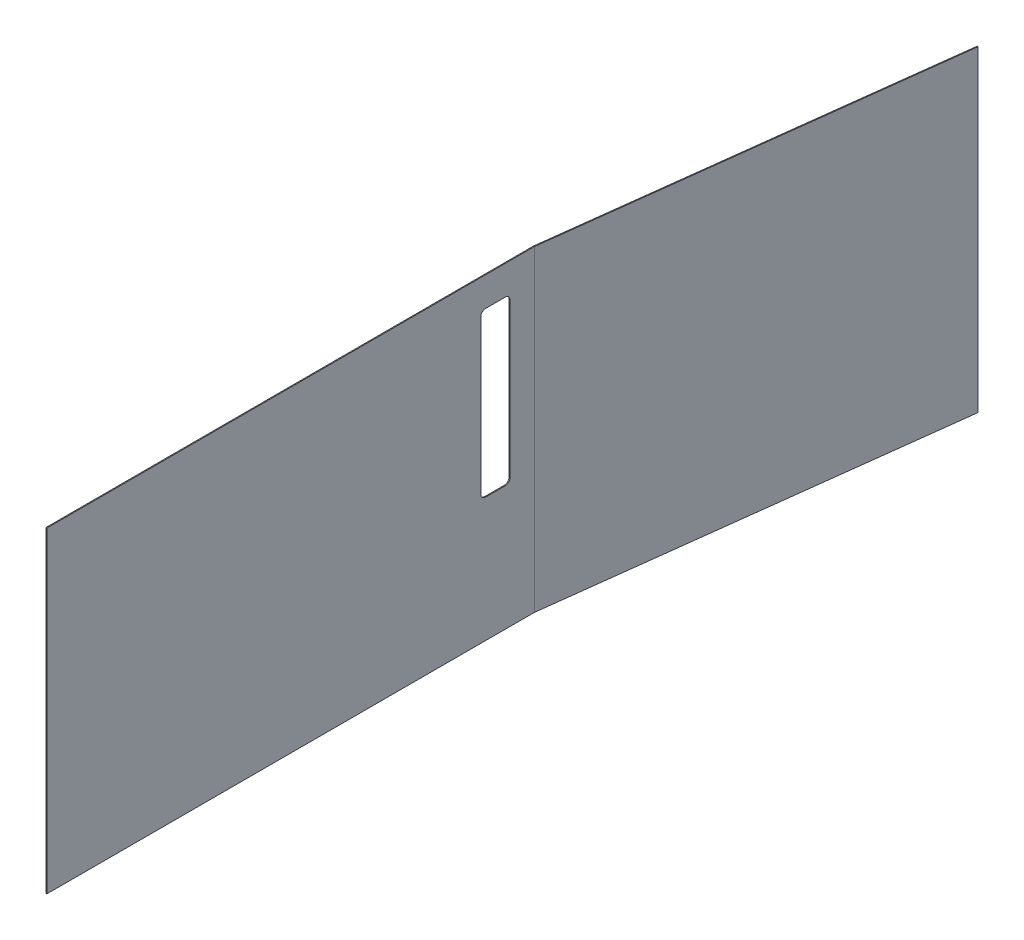
ISO-10303-21;
HEADER;
FILE_DESCRIPTION(('STEP AP214'),'2;1');
FILE_NAME('part.step','',(''),(''),'','','');
FILE_SCHEMA(('AUTOMOTIVE_DESIGN { 1 0 10303 214 1 1 1 1 }'));
ENDSEC;
DATA;
#1=APPLICATION_CONTEXT('core data for automotive mechanical design processes');
#2=APPLICATION_PROTOCOL_DEFINITION('international standard','automotive_design',2000,#1);
#3=PRODUCT_CONTEXT('',#1,'mechanical');
#4=PRODUCT('Part','Part','',(#3));
#5=PRODUCT_RELATED_PRODUCT_CATEGORY('part','',(#4));
#6=PRODUCT_DEFINITION_FORMATION('','',#4);
#7=PRODUCT_DEFINITION_CONTEXT('part definition',#1,'design');
#8=PRODUCT_DEFINITION('design','',#6,#7);
#9=PRODUCT_DEFINITION_SHAPE('','',#8);
#10=(LENGTH_UNIT() NAMED_UNIT(*) SI_UNIT(.MILLI.,.METRE.));
#11=(NAMED_UNIT(*) PLANE_ANGLE_UNIT() SI_UNIT($,.RADIAN.));
#12=(NAMED_UNIT(*) SI_UNIT($,.STERADIAN.) SOLID_ANGLE_UNIT());
#13=UNCERTAINTY_MEASURE_WITH_UNIT(LENGTH_MEASURE(1.E-05),#10,'distance_accuracy_value','');
#14=(GEOMETRIC_REPRESENTATION_CONTEXT(3) GLOBAL_UNCERTAINTY_ASSIGNED_CONTEXT((#13)) GLOBAL_UNIT_ASSIGNED_CONTEXT((#10,
#11,#12)) REPRESENTATION_CONTEXT('',''));
#15=CARTESIAN_POINT('',(0.,0.,0.));
#16=DIRECTION('',(0.,0.,1.));
#17=DIRECTION('',(1.,0.,0.));
#18=AXIS2_PLACEMENT_3D('',#15,#16,#17);
#19=CARTESIAN_POINT('',(0.,650.,0.0452971883437847));
#20=DIRECTION('',(0.,1.,0.));
#21=DIRECTION('',(0.,0.,1.));
#22=AXIS2_PLACEMENT_3D('',#19,#20,#21);
#23=PLANE('',#22);
#24=DIRECTION('',(-1.,0.,0.));
#25=VECTOR('',#24,1.);
#26=CARTESIAN_POINT('',(0.,650.,0.0452971883437847));
#27=LINE('',#26,#25);
#28=CARTESIAN_POINT('',(0.,650.,0.0452971883437847));
#29=VERTEX_POINT('',#28);
#30=CARTESIAN_POINT('',(-1.90000000000001,650.,0.0452971883438525));
#31=VERTEX_POINT('',#30);
#32=EDGE_CURVE('E277',#29,#31,#27,.T.);
#33=ORIENTED_EDGE('',*,*,#32,.F.);
#34=CARTESIAN_POINT('',(0.736599999999987,650.,0.045297188343758));
#35=DIRECTION('',(0.,1.,0.));
#36=DIRECTION('',(0.,0.,1.));
#37=AXIS2_PLACEMENT_3D('',#34,#35,#36);
#38=CIRCLE('',#37,0.7366);
#39=CARTESIAN_POINT('',(0.0055501092090609,650.,-0.0449558845933933));
#40=VERTEX_POINT('',#39);
#41=EDGE_CURVE('E226',#29,#40,#38,.F.);
#42=ORIENTED_EDGE('',*,*,#41,.T.);
#43=DIRECTION('',(0.992465233221436,0.,0.122526572002646));
#44=VECTOR('',#43,1.);
#45=CARTESIAN_POINT('',(-1.88013383391167,650.,-0.277756371398422));
#46=LINE('',#45,#44);
#47=CARTESIAN_POINT('',(-1.88013383391167,650.,-0.277756371398422));
#48=VERTEX_POINT('',#47);
#49=EDGE_CURVE('E275',#48,#40,#46,.T.);
#50=ORIENTED_EDGE('',*,*,#49,.F.);
#51=CARTESIAN_POINT('',(0.736599999999987,650.,0.045297188343758));
#52=DIRECTION('',(0.,1.,0.));
#53=DIRECTION('',(1.,0.,0.));
#54=AXIS2_PLACEMENT_3D('',#51,#52,#53);
#55=CIRCLE('',#54,2.6366);
#56=EDGE_CURVE('E214',#31,#48,#55,.F.);
#57=ORIENTED_EDGE('',*,*,#56,.F.);
#58=EDGE_LOOP('',(#33,#42,#50,#57));
#59=FACE_BOUND('',#58,.T.);
#60=ADVANCED_FACE('F43',(#59),#23,.T.);
#61=CARTESIAN_POINT('',(-1.88013383391167,650.,-0.277756371398422));
#62=DIRECTION('',(0.,1.,0.));
#63=DIRECTION('',(0.,0.,1.));
#64=AXIS2_PLACEMENT_3D('',#61,#62,#63);
#65=PLANE('',#64);
#66=DIRECTION('',(0.,0.,-1.));
#67=VECTOR('',#66,1.);
#68=CARTESIAN_POINT('',(0.,650.,1000.));
#69=LINE('',#68,#67);
#70=CARTESIAN_POINT('',(0.,650.,1000.));
#71=VERTEX_POINT('',#70);
#72=EDGE_CURVE('E223',#71,#29,#69,.T.);
#73=ORIENTED_EDGE('',*,*,#72,.T.);
#74=ORIENTED_EDGE('',*,*,#32,.T.);
#75=DIRECTION('',(0.,0.,-1.));
#76=VECTOR('',#75,1.);
#77=CARTESIAN_POINT('',(-1.9,650.,1000.));
#78=LINE('',#77,#76);
#79=CARTESIAN_POINT('',(-1.9,650.,1000.));
#80=VERTEX_POINT('',#79);
#81=EDGE_CURVE('E217',#80,#31,#78,.T.);
#82=ORIENTED_EDGE('',*,*,#81,.F.);
#83=DIRECTION('',(-1.,0.,0.));
#84=VECTOR('',#83,1.);
#85=CARTESIAN_POINT('',(0.,650.,1000.));
#86=LINE('',#85,#84);
#87=EDGE_CURVE('E220',#71,#80,#86,.T.);
#88=ORIENTED_EDGE('',*,*,#87,.F.);
#89=EDGE_LOOP('',(#73,#74,#82,#88));
#90=FACE_BOUND('',#89,.T.);
#91=ADVANCED_FACE('F330',(#90),#65,.T.);
#92=CARTESIAN_POINT('',(0.0055501092090609,0.,-0.0449558845933933));
#93=DIRECTION('',(0.,-1.,0.));
#94=DIRECTION('',(0.,0.,-1.));
#95=AXIS2_PLACEMENT_3D('',#92,#93,#94);
#96=PLANE('',#95);
#97=DIRECTION('',(-0.992465233221436,0.,-0.122526572002646));
#98=VECTOR('',#97,1.);
#99=CARTESIAN_POINT('',(0.0055501092090609,0.,-0.0449558845933933));
#100=LINE('',#99,#98);
#101=CARTESIAN_POINT('',(0.0055501092090609,0.,-0.0449558845933933));
#102=VERTEX_POINT('',#101);
#103=CARTESIAN_POINT('',(-1.88013383391167,0.,-0.277756371398422));
#104=VERTEX_POINT('',#103);
#105=EDGE_CURVE('E273',#102,#104,#100,.T.);
#106=ORIENTED_EDGE('',*,*,#105,.F.);
#107=CARTESIAN_POINT('',(0.736599999999987,0.,0.045297188343758));
#108=DIRECTION('',(0.,1.,0.));
#109=DIRECTION('',(0.,0.,1.));
#110=AXIS2_PLACEMENT_3D('',#107,#108,#109);
#111=CIRCLE('',#110,0.7366);
#112=CARTESIAN_POINT('',(0.,0.,0.0452971883437847));
#113=VERTEX_POINT('',#112);
#114=EDGE_CURVE('E208',#113,#102,#111,.F.);
#115=ORIENTED_EDGE('',*,*,#114,.F.);
#116=DIRECTION('',(1.,0.,0.));
#117=VECTOR('',#116,1.);
#118=CARTESIAN_POINT('',(-1.90000000000001,0.,0.0452971883438525));
#119=LINE('',#118,#117);
#120=CARTESIAN_POINT('',(-1.90000000000001,0.,0.0452971883438525));
#121=VERTEX_POINT('',#120);
#122=EDGE_CURVE('E271',#121,#113,#119,.T.);
#123=ORIENTED_EDGE('',*,*,#122,.F.);
#124=CARTESIAN_POINT('',(0.736599999999987,0.,0.045297188343758));
#125=DIRECTION('',(0.,1.,0.));
#126=DIRECTION('',(1.,0.,0.));
#127=AXIS2_PLACEMENT_3D('',#124,#125,#126);
#128=CIRCLE('',#127,2.6366);
#129=EDGE_CURVE('E238',#121,#104,#128,.F.);
#130=ORIENTED_EDGE('',*,*,#129,.T.);
#131=EDGE_LOOP('',(#106,#115,#123,#130));
#132=FACE_BOUND('',#131,.T.);
#133=ADVANCED_FACE('F335',(#132),#96,.T.);
#134=CARTESIAN_POINT('',(-1.90000000000001,0.,0.0452971883438525));
#135=DIRECTION('',(0.,-1.,0.));
#136=DIRECTION('',(0.,0.,-1.));
#137=AXIS2_PLACEMENT_3D('',#134,#135,#136);
#138=PLANE('',#137);
#139=DIRECTION('',(0.122526572002646,0.,-0.992465233221436));
#140=VECTOR('',#139,1.);
#141=CARTESIAN_POINT('',(0.,0.,0.));
#142=LINE('',#141,#140);
#143=CARTESIAN_POINT('',(100.,0.,-810.));
#144=VERTEX_POINT('',#143);
#145=EDGE_CURVE('E194',#102,#144,#142,.T.);
#146=ORIENTED_EDGE('',*,*,#145,.F.);
#147=ORIENTED_EDGE('',*,*,#105,.T.);
#148=DIRECTION('',(0.122526572002646,0.,-0.992465233221437));
#149=VECTOR('',#148,1.);
#150=CARTESIAN_POINT('',(-1.88568394312073,0.,-0.232800486805028));
#151=LINE('',#150,#149);
#152=CARTESIAN_POINT('',(98.1143160568793,0.,-810.232800486805));
#153=VERTEX_POINT('',#152);
#154=EDGE_CURVE('E235',#104,#153,#151,.T.);
#155=ORIENTED_EDGE('',*,*,#154,.T.);
#156=DIRECTION('',(0.992465233221412,0.,0.122526572002845));
#157=VECTOR('',#156,1.);
#158=CARTESIAN_POINT('',(98.1143160568793,0.,-810.232800486805));
#159=LINE('',#158,#157);
#160=EDGE_CURVE('E232',#153,#144,#159,.T.);
#161=ORIENTED_EDGE('',*,*,#160,.T.);
#162=EDGE_LOOP('',(#146,#147,#155,#161));
#163=FACE_BOUND('',#162,.T.);
#164=ADVANCED_FACE('F370',(#163),#138,.T.);
#165=CARTESIAN_POINT('',(0.,650.,0.));
#166=DIRECTION('',(-0.992465233221437,0.,-0.122526572002646));
#167=DIRECTION('',(-0.122526572002646,0.,0.992465233221437));
#168=AXIS2_PLACEMENT_3D('',#165,#166,#167);
#169=PLANE('',#168);
#170=ORIENTED_EDGE('',*,*,#145,.T.);
#171=DIRECTION('',(0.,-1.,0.));
#172=VECTOR('',#171,1.);
#173=CARTESIAN_POINT('',(100.,650.,-810.));
#174=LINE('',#173,#172);
#175=CARTESIAN_POINT('',(100.,650.,-810.));
#176=VERTEX_POINT('',#175);
#177=EDGE_CURVE('E269',#176,#144,#174,.T.);
#178=ORIENTED_EDGE('',*,*,#177,.F.);
#179=DIRECTION('',(0.122526572002646,0.,-0.992465233221436));
#180=VECTOR('',#179,1.);
#181=CARTESIAN_POINT('',(0.,650.,0.));
#182=LINE('',#181,#180);
#183=EDGE_CURVE('E205',#40,#176,#182,.T.);
#184=ORIENTED_EDGE('',*,*,#183,.F.);
#185=DIRECTION('',(0.,-1.,0.));
#186=VECTOR('',#185,1.);
#187=CARTESIAN_POINT('',(0.0055501092090609,650.,-0.0449558845933933));
#188=LINE('',#187,#186);
#189=EDGE_CURVE('E229',#40,#102,#188,.T.);
#190=ORIENTED_EDGE('',*,*,#189,.T.);
#191=EDGE_LOOP('',(#170,#178,#184,#190));
#192=FACE_BOUND('',#191,.T.);
#193=ADVANCED_FACE('F353',(#192),#169,.F.);
#194=CARTESIAN_POINT('',(98.1143160568793,650.,-810.232800486805));
#195=DIRECTION('',(0.122526572002845,0.,-0.992465233221412));
#196=DIRECTION('',(-0.992465233221412,0.,-0.122526572002845));
#197=AXIS2_PLACEMENT_3D('',#194,#195,#196);
#198=PLANE('',#197);
#199=ORIENTED_EDGE('',*,*,#160,.F.);
#200=DIRECTION('',(0.,-1.,0.));
#201=VECTOR('',#200,1.);
#202=CARTESIAN_POINT('',(98.1143160568793,650.,-810.232800486805));
#203=LINE('',#202,#201);
#204=CARTESIAN_POINT('',(98.1143160568793,650.,-810.232800486805));
#205=VERTEX_POINT('',#204);
#206=EDGE_CURVE('E267',#205,#153,#203,.T.);
#207=ORIENTED_EDGE('',*,*,#206,.F.);
#208=DIRECTION('',(0.992465233221412,0.,0.122526572002845));
#209=VECTOR('',#208,1.);
#210=CARTESIAN_POINT('',(98.1143160568793,650.,-810.232800486805));
#211=LINE('',#210,#209);
#212=EDGE_CURVE('E207',#205,#176,#211,.T.);
#213=ORIENTED_EDGE('',*,*,#212,.T.);
#214=ORIENTED_EDGE('',*,*,#177,.T.);
#215=EDGE_LOOP('',(#199,#207,#213,#214));
#216=FACE_BOUND('',#215,.T.);
#217=ADVANCED_FACE('F373',(#216),#198,.T.);
#218=CARTESIAN_POINT('',(-1.88568394312073,650.,-0.232800486805028));
#219=DIRECTION('',(-0.992465233221436,0.,-0.122526572002646));
#220=DIRECTION('',(-0.122526572002646,0.,0.992465233221436));
#221=AXIS2_PLACEMENT_3D('',#218,#219,#220);
#222=PLANE('',#221);
#223=ORIENTED_EDGE('',*,*,#154,.F.);
#224=DIRECTION('',(0.,-1.,0.));
#225=VECTOR('',#224,1.);
#226=CARTESIAN_POINT('',(-1.88013383391167,650.,-0.277756371398422));
#227=LINE('',#226,#225);
#228=EDGE_CURVE('E264',#48,#104,#227,.T.);
#229=ORIENTED_EDGE('',*,*,#228,.F.);
#230=DIRECTION('',(0.122526572002646,0.,-0.992465233221437));
#231=VECTOR('',#230,1.);
#232=CARTESIAN_POINT('',(-1.88568394312073,650.,-0.232800486805028));
#233=LINE('',#232,#231);
#234=EDGE_CURVE('E211',#48,#205,#233,.T.);
#235=ORIENTED_EDGE('',*,*,#234,.T.);
#236=ORIENTED_EDGE('',*,*,#206,.T.);
#237=EDGE_LOOP('',(#223,#229,#235,#236));
#238=FACE_BOUND('',#237,.T.);
#239=ADVANCED_FACE('F360',(#238),#222,.T.);
#240=CARTESIAN_POINT('',(0.736599999999987,650.,0.045297188343758));
#241=DIRECTION('',(0.,-1.,0.));
#242=DIRECTION('',(0.,0.,-1.));
#243=AXIS2_PLACEMENT_3D('',#240,#241,#242);
#244=CYLINDRICAL_SURFACE('',#243,2.6366);
#245=ORIENTED_EDGE('',*,*,#129,.F.);
#246=DIRECTION('',(0.,-1.,0.));
#247=VECTOR('',#246,1.);
#248=CARTESIAN_POINT('',(-1.90000000000001,650.,0.0452971883438525));
#249=LINE('',#248,#247);
#250=EDGE_CURVE('E261',#31,#121,#249,.T.);
#251=ORIENTED_EDGE('',*,*,#250,.F.);
#252=ORIENTED_EDGE('',*,*,#56,.T.);
#253=ORIENTED_EDGE('',*,*,#228,.T.);
#254=EDGE_LOOP('',(#245,#251,#252,#253));
#255=FACE_BOUND('',#254,.T.);
#256=ADVANCED_FACE('F363',(#255),#244,.T.);
#257=CARTESIAN_POINT('',(-1.9,650.,1000.));
#258=DIRECTION('',(-1.,0.,0.));
#259=DIRECTION('',(0.,0.,1.));
#260=AXIS2_PLACEMENT_3D('',#257,#258,#259);
#261=PLANE('',#260);
#262=CARTESIAN_POINT('',(-1.9,265.,100.));
#263=DIRECTION('',(-1.,0.,0.));
#264=DIRECTION('',(0.,0.,1.));
#265=AXIS2_PLACEMENT_3D('',#262,#263,#264);
#266=CIRCLE('',#265,10.);
#267=CARTESIAN_POINT('',(-1.9,255.,100.));
#268=VERTEX_POINT('',#267);
#269=CARTESIAN_POINT('',(-1.9,265.,110.));
#270=VERTEX_POINT('',#269);
#271=EDGE_CURVE('E57',#268,#270,#266,.T.);
#272=ORIENTED_EDGE('',*,*,#271,.F.);
#273=DIRECTION('',(0.,0.,1.));
#274=VECTOR('',#273,1.);
#275=CARTESIAN_POINT('',(-1.9,255.,60.));
#276=LINE('',#275,#274);
#277=CARTESIAN_POINT('',(-1.9,255.,60.));
#278=VERTEX_POINT('',#277);
#279=EDGE_CURVE('E189',#278,#268,#276,.T.);
#280=ORIENTED_EDGE('',*,*,#279,.F.);
#281=CARTESIAN_POINT('',(-1.9,265.,60.));
#282=DIRECTION('',(-1.,0.,0.));
#283=DIRECTION('',(0.,0.,1.));
#284=AXIS2_PLACEMENT_3D('',#281,#282,#283);
#285=CIRCLE('',#284,10.);
#286=CARTESIAN_POINT('',(-1.9,265.,50.));
#287=VERTEX_POINT('',#286);
#288=EDGE_CURVE('E186',#287,#278,#285,.T.);
#289=ORIENTED_EDGE('',*,*,#288,.F.);
#290=DIRECTION('',(0.,-1.,0.));
#291=VECTOR('',#290,1.);
#292=CARTESIAN_POINT('',(-1.9,580.,50.));
#293=LINE('',#292,#291);
#294=CARTESIAN_POINT('',(-1.9,580.,50.));
#295=VERTEX_POINT('',#294);
#296=EDGE_CURVE('E183',#295,#287,#293,.T.);
#297=ORIENTED_EDGE('',*,*,#296,.F.);
#298=CARTESIAN_POINT('',(-1.9,580.,60.));
#299=DIRECTION('',(-1.,0.,0.));
#300=DIRECTION('',(0.,0.,1.));
#301=AXIS2_PLACEMENT_3D('',#298,#299,#300);
#302=CIRCLE('',#301,10.);
#303=CARTESIAN_POINT('',(-1.9,590.,60.));
#304=VERTEX_POINT('',#303);
#305=EDGE_CURVE('E177',#304,#295,#302,.T.);
#306=ORIENTED_EDGE('',*,*,#305,.F.);
#307=DIRECTION('',(0.,0.,-1.));
#308=VECTOR('',#307,1.);
#309=CARTESIAN_POINT('',(-1.9,590.,60.));
#310=LINE('',#309,#308);
#311=CARTESIAN_POINT('',(-1.9,590.,100.));
#312=VERTEX_POINT('',#311);
#313=EDGE_CURVE('E175',#312,#304,#310,.T.);
#314=ORIENTED_EDGE('',*,*,#313,.F.);
#315=CARTESIAN_POINT('',(-1.9,580.,100.));
#316=DIRECTION('',(-1.,0.,0.));
#317=DIRECTION('',(0.,0.,-1.));
#318=AXIS2_PLACEMENT_3D('',#315,#316,#317);
#319=CIRCLE('',#318,10.);
#320=CARTESIAN_POINT('',(-1.9,580.,110.));
#321=VERTEX_POINT('',#320);
#322=EDGE_CURVE('E158',#321,#312,#319,.T.);
#323=ORIENTED_EDGE('',*,*,#322,.F.);
#324=DIRECTION('',(0.,1.,0.));
#325=VECTOR('',#324,1.);
#326=CARTESIAN_POINT('',(-1.9,580.,110.));
#327=LINE('',#326,#325);
#328=EDGE_CURVE('E167',#270,#321,#327,.T.);
#329=ORIENTED_EDGE('',*,*,#328,.F.);
#330=EDGE_LOOP('',(#272,#280,#289,#297,#306,#314,#323,#329));
#331=FACE_BOUND('',#330,.T.);
#332=DIRECTION('',(0.,0.,-1.));
#333=VECTOR('',#332,1.);
#334=CARTESIAN_POINT('',(-1.9,0.,1000.));
#335=LINE('',#334,#333);
#336=CARTESIAN_POINT('',(-1.9,0.,1000.));
#337=VERTEX_POINT('',#336);
#338=EDGE_CURVE('E241',#337,#121,#335,.T.);
#339=ORIENTED_EDGE('',*,*,#338,.F.);
#340=DIRECTION('',(0.,-1.,0.));
#341=VECTOR('',#340,1.);
#342=CARTESIAN_POINT('',(-1.9,650.,1000.));
#343=LINE('',#342,#341);
#344=EDGE_CURVE('E259',#80,#337,#343,.T.);
#345=ORIENTED_EDGE('',*,*,#344,.F.);
#346=ORIENTED_EDGE('',*,*,#81,.T.);
#347=ORIENTED_EDGE('',*,*,#250,.T.);
#348=EDGE_LOOP('',(#339,#345,#346,#347));
#349=FACE_BOUND('',#348,.T.);
#350=ADVANCED_FACE('F171',(#331,#349),#261,.T.);
#351=CARTESIAN_POINT('',(0.,650.,1000.));
#352=DIRECTION('',(0.,0.,1.));
#353=DIRECTION('',(1.,0.,0.));
#354=AXIS2_PLACEMENT_3D('',#351,#352,#353);
#355=PLANE('',#354);
#356=DIRECTION('',(-1.,0.,0.));
#357=VECTOR('',#356,1.);
#358=CARTESIAN_POINT('',(0.,0.,1000.));
#359=LINE('',#358,#357);
#360=CARTESIAN_POINT('',(0.,0.,1000.));
#361=VERTEX_POINT('',#360);
#362=EDGE_CURVE('E244',#361,#337,#359,.T.);
#363=ORIENTED_EDGE('',*,*,#362,.F.);
#364=DIRECTION('',(0.,-1.,0.));
#365=VECTOR('',#364,1.);
#366=CARTESIAN_POINT('',(0.,650.,1000.));
#367=LINE('',#366,#365);
#368=EDGE_CURVE('E257',#71,#361,#367,.T.);
#369=ORIENTED_EDGE('',*,*,#368,.F.);
#370=ORIENTED_EDGE('',*,*,#87,.T.);
#371=ORIENTED_EDGE('',*,*,#344,.T.);
#372=EDGE_LOOP('',(#363,#369,#370,#371));
#373=FACE_BOUND('',#372,.T.);
#374=ADVANCED_FACE('F367',(#373),#355,.T.);
#375=CARTESIAN_POINT('',(0.,650.,1000.));
#376=DIRECTION('',(-1.,0.,0.));
#377=DIRECTION('',(0.,0.,1.));
#378=AXIS2_PLACEMENT_3D('',#375,#376,#377);
#379=PLANE('',#378);
#380=DIRECTION('',(0.,0.,1.));
#381=VECTOR('',#380,1.);
#382=CARTESIAN_POINT('',(0.,254.999999999999,999.999999999999));
#383=LINE('',#382,#381);
#384=CARTESIAN_POINT('',(0.,255.,60.));
#385=VERTEX_POINT('',#384);
#386=CARTESIAN_POINT('',(0.,255.,100.));
#387=VERTEX_POINT('',#386);
#388=EDGE_CURVE('E50',#385,#387,#383,.T.);
#389=ORIENTED_EDGE('',*,*,#388,.T.);
#390=CARTESIAN_POINT('',(0.,265.,100.));
#391=DIRECTION('',(-1.,0.,0.));
#392=DIRECTION('',(0.,0.,1.));
#393=AXIS2_PLACEMENT_3D('',#390,#391,#392);
#394=CIRCLE('',#393,10.);
#395=CARTESIAN_POINT('',(0.,265.,110.));
#396=VERTEX_POINT('',#395);
#397=EDGE_CURVE('E11',#387,#396,#394,.T.);
#398=ORIENTED_EDGE('',*,*,#397,.T.);
#399=DIRECTION('',(0.,1.,0.));
#400=VECTOR('',#399,1.);
#401=CARTESIAN_POINT('',(0.,650.,110.));
#402=LINE('',#401,#400);
#403=CARTESIAN_POINT('',(0.,580.,110.));
#404=VERTEX_POINT('',#403);
#405=EDGE_CURVE('E279',#396,#404,#402,.T.);
#406=ORIENTED_EDGE('',*,*,#405,.T.);
#407=CARTESIAN_POINT('',(0.,580.,100.));
#408=DIRECTION('',(-1.,0.,0.));
#409=DIRECTION('',(0.,0.,1.));
#410=AXIS2_PLACEMENT_3D('',#407,#408,#409);
#411=CIRCLE('',#410,10.);
#412=CARTESIAN_POINT('',(0.,590.,100.));
#413=VERTEX_POINT('',#412);
#414=EDGE_CURVE('E161',#404,#413,#411,.T.);
#415=ORIENTED_EDGE('',*,*,#414,.T.);
#416=DIRECTION('',(0.,0.,-1.));
#417=VECTOR('',#416,1.);
#418=CARTESIAN_POINT('',(0.,590.,1000.));
#419=LINE('',#418,#417);
#420=CARTESIAN_POINT('',(0.,590.,60.));
#421=VERTEX_POINT('',#420);
#422=EDGE_CURVE('E282',#413,#421,#419,.T.);
#423=ORIENTED_EDGE('',*,*,#422,.T.);
#424=CARTESIAN_POINT('',(0.,580.,60.));
#425=DIRECTION('',(-1.,0.,0.));
#426=DIRECTION('',(0.,0.,1.));
#427=AXIS2_PLACEMENT_3D('',#424,#425,#426);
#428=CIRCLE('',#427,10.);
#429=CARTESIAN_POINT('',(0.,580.,50.));
#430=VERTEX_POINT('',#429);
#431=EDGE_CURVE('E285',#421,#430,#428,.T.);
#432=ORIENTED_EDGE('',*,*,#431,.T.);
#433=DIRECTION('',(0.,-1.,0.));
#434=VECTOR('',#433,1.);
#435=CARTESIAN_POINT('',(0.,650.,49.9999999999999));
#436=LINE('',#435,#434);
#437=CARTESIAN_POINT('',(0.,265.,50.));
#438=VERTEX_POINT('',#437);
#439=EDGE_CURVE('E288',#430,#438,#436,.T.);
#440=ORIENTED_EDGE('',*,*,#439,.T.);
#441=CARTESIAN_POINT('',(0.,265.,60.));
#442=DIRECTION('',(-1.,0.,0.));
#443=DIRECTION('',(0.,0.,1.));
#444=AXIS2_PLACEMENT_3D('',#441,#442,#443);
#445=CIRCLE('',#444,10.);
#446=EDGE_CURVE('E291',#438,#385,#445,.T.);
#447=ORIENTED_EDGE('',*,*,#446,.T.);
#448=EDGE_LOOP('',(#389,#398,#406,#415,#423,#432,#440,#447));
#449=FACE_BOUND('',#448,.T.);
#450=DIRECTION('',(0.,0.,-1.));
#451=VECTOR('',#450,1.);
#452=CARTESIAN_POINT('',(0.,0.,1000.));
#453=LINE('',#452,#451);
#454=EDGE_CURVE('E247',#361,#113,#453,.T.);
#455=ORIENTED_EDGE('',*,*,#454,.T.);
#456=DIRECTION('',(0.,-1.,0.));
#457=VECTOR('',#456,1.);
#458=CARTESIAN_POINT('',(0.,650.,0.0452971883437847));
#459=LINE('',#458,#457);
#460=EDGE_CURVE('E254',#29,#113,#459,.T.);
#461=ORIENTED_EDGE('',*,*,#460,.F.);
#462=ORIENTED_EDGE('',*,*,#72,.F.);
#463=ORIENTED_EDGE('',*,*,#368,.T.);
#464=EDGE_LOOP('',(#455,#461,#462,#463));
#465=FACE_BOUND('',#464,.T.);
#466=ADVANCED_FACE('F295',(#449,#465),#379,.F.);
#467=CARTESIAN_POINT('',(0.736599999999987,650.,0.045297188343758));
#468=DIRECTION('',(0.,-1.,0.));
#469=DIRECTION('',(0.,0.,-1.));
#470=AXIS2_PLACEMENT_3D('',#467,#468,#469);
#471=CYLINDRICAL_SURFACE('',#470,0.7366);
#472=ORIENTED_EDGE('',*,*,#114,.T.);
#473=ORIENTED_EDGE('',*,*,#189,.F.);
#474=ORIENTED_EDGE('',*,*,#41,.F.);
#475=ORIENTED_EDGE('',*,*,#460,.T.);
#476=EDGE_LOOP('',(#472,#473,#474,#475));
#477=FACE_BOUND('',#476,.T.);
#478=ADVANCED_FACE('F348',(#477),#471,.F.);
#479=CARTESIAN_POINT('',(0.736599999999987,650.,0.045297188343758));
#480=DIRECTION('',(0.,1.,0.));
#481=DIRECTION('',(1.,0.,0.));
#482=AXIS2_PLACEMENT_3D('',#479,#480,#481);
#483=PLANE('',#482);
#484=ORIENTED_EDGE('',*,*,#183,.T.);
#485=ORIENTED_EDGE('',*,*,#212,.F.);
#486=ORIENTED_EDGE('',*,*,#234,.F.);
#487=ORIENTED_EDGE('',*,*,#49,.T.);
#488=EDGE_LOOP('',(#484,#485,#486,#487));
#489=FACE_BOUND('',#488,.T.);
#490=ADVANCED_FACE('F324',(#489),#483,.T.);
#491=CARTESIAN_POINT('',(0.736599999999987,0.,0.045297188343758));
#492=DIRECTION('',(0.,1.,0.));
#493=DIRECTION('',(1.,0.,0.));
#494=AXIS2_PLACEMENT_3D('',#491,#492,#493);
#495=PLANE('',#494);
#496=ORIENTED_EDGE('',*,*,#338,.T.);
#497=ORIENTED_EDGE('',*,*,#122,.T.);
#498=ORIENTED_EDGE('',*,*,#454,.F.);
#499=ORIENTED_EDGE('',*,*,#362,.T.);
#500=EDGE_LOOP('',(#496,#497,#498,#499));
#501=FACE_BOUND('',#500,.T.);
#502=ADVANCED_FACE('F317',(#501),#495,.F.);
#503=CARTESIAN_POINT('',(100.,265.,100.));
#504=DIRECTION('',(-1.,0.,0.));
#505=DIRECTION('',(0.,0.,1.));
#506=AXIS2_PLACEMENT_3D('',#503,#504,#505);
#507=CYLINDRICAL_SURFACE('',#506,10.);
#508=DIRECTION('',(-1.,0.,0.));
#509=VECTOR('',#508,1.);
#510=CARTESIAN_POINT('',(100.,255.,100.));
#511=LINE('',#510,#509);
#512=EDGE_CURVE('E192',#387,#268,#511,.T.);
#513=ORIENTED_EDGE('',*,*,#512,.T.);
#514=ORIENTED_EDGE('',*,*,#271,.T.);
#515=DIRECTION('',(-1.,0.,0.));
#516=VECTOR('',#515,1.);
#517=CARTESIAN_POINT('',(100.,265.,110.));
#518=LINE('',#517,#516);
#519=EDGE_CURVE('E164',#396,#270,#518,.T.);
#520=ORIENTED_EDGE('',*,*,#519,.F.);
#521=ORIENTED_EDGE('',*,*,#397,.F.);
#522=EDGE_LOOP('',(#513,#514,#520,#521));
#523=FACE_BOUND('',#522,.T.);
#524=ADVANCED_FACE('F315',(#523),#507,.F.);
#525=CARTESIAN_POINT('',(100.,255.,60.));
#526=DIRECTION('',(0.,-1.,0.));
#527=DIRECTION('',(0.,0.,-1.));
#528=AXIS2_PLACEMENT_3D('',#525,#526,#527);
#529=PLANE('',#528);
#530=DIRECTION('',(-1.,0.,0.));
#531=VECTOR('',#530,1.);
#532=CARTESIAN_POINT('',(100.,255.,60.));
#533=LINE('',#532,#531);
#534=EDGE_CURVE('E195',#385,#278,#533,.T.);
#535=ORIENTED_EDGE('',*,*,#534,.T.);
#536=ORIENTED_EDGE('',*,*,#279,.T.);
#537=ORIENTED_EDGE('',*,*,#512,.F.);
#538=ORIENTED_EDGE('',*,*,#388,.F.);
#539=EDGE_LOOP('',(#535,#536,#537,#538));
#540=FACE_BOUND('',#539,.T.);
#541=ADVANCED_FACE('F300',(#540),#529,.F.);
#542=CARTESIAN_POINT('',(100.,265.,60.));
#543=DIRECTION('',(-1.,0.,0.));
#544=DIRECTION('',(0.,0.,1.));
#545=AXIS2_PLACEMENT_3D('',#542,#543,#544);
#546=CYLINDRICAL_SURFACE('',#545,10.);
#547=DIRECTION('',(-1.,0.,0.));
#548=VECTOR('',#547,1.);
#549=CARTESIAN_POINT('',(100.,265.,50.));
#550=LINE('',#549,#548);
#551=EDGE_CURVE('E197',#438,#287,#550,.T.);
#552=ORIENTED_EDGE('',*,*,#551,.T.);
#553=ORIENTED_EDGE('',*,*,#288,.T.);
#554=ORIENTED_EDGE('',*,*,#534,.F.);
#555=ORIENTED_EDGE('',*,*,#446,.F.);
#556=EDGE_LOOP('',(#552,#553,#554,#555));
#557=FACE_BOUND('',#556,.T.);
#558=ADVANCED_FACE('F302',(#557),#546,.F.);
#559=CARTESIAN_POINT('',(100.,580.,50.));
#560=DIRECTION('',(0.,0.,-1.));
#561=DIRECTION('',(0.,1.,0.));
#562=AXIS2_PLACEMENT_3D('',#559,#560,#561);
#563=PLANE('',#562);
#564=DIRECTION('',(-1.,0.,0.));
#565=VECTOR('',#564,1.);
#566=CARTESIAN_POINT('',(100.,580.,50.));
#567=LINE('',#566,#565);
#568=EDGE_CURVE('E199',#430,#295,#567,.T.);
#569=ORIENTED_EDGE('',*,*,#568,.T.);
#570=ORIENTED_EDGE('',*,*,#296,.T.);
#571=ORIENTED_EDGE('',*,*,#551,.F.);
#572=ORIENTED_EDGE('',*,*,#439,.F.);
#573=EDGE_LOOP('',(#569,#570,#571,#572));
#574=FACE_BOUND('',#573,.T.);
#575=ADVANCED_FACE('F308',(#574),#563,.F.);
#576=CARTESIAN_POINT('',(100.,580.,60.));
#577=DIRECTION('',(-1.,0.,0.));
#578=DIRECTION('',(0.,0.,1.));
#579=AXIS2_PLACEMENT_3D('',#576,#577,#578);
#580=CYLINDRICAL_SURFACE('',#579,10.);
#581=DIRECTION('',(-1.,0.,0.));
#582=VECTOR('',#581,1.);
#583=CARTESIAN_POINT('',(100.,590.,60.));
#584=LINE('',#583,#582);
#585=EDGE_CURVE('E201',#421,#304,#584,.T.);
#586=ORIENTED_EDGE('',*,*,#585,.T.);
#587=ORIENTED_EDGE('',*,*,#305,.T.);
#588=ORIENTED_EDGE('',*,*,#568,.F.);
#589=ORIENTED_EDGE('',*,*,#431,.F.);
#590=EDGE_LOOP('',(#586,#587,#588,#589));
#591=FACE_BOUND('',#590,.T.);
#592=ADVANCED_FACE('F311',(#591),#580,.F.);
#593=CARTESIAN_POINT('',(100.,590.,60.));
#594=DIRECTION('',(0.,1.,0.));
#595=DIRECTION('',(0.,0.,1.));
#596=AXIS2_PLACEMENT_3D('',#593,#594,#595);
#597=PLANE('',#596);
#598=DIRECTION('',(-1.,0.,0.));
#599=VECTOR('',#598,1.);
#600=CARTESIAN_POINT('',(100.,590.,100.));
#601=LINE('',#600,#599);
#602=EDGE_CURVE('E163',#413,#312,#601,.T.);
#603=ORIENTED_EDGE('',*,*,#602,.T.);
#604=ORIENTED_EDGE('',*,*,#313,.T.);
#605=ORIENTED_EDGE('',*,*,#585,.F.);
#606=ORIENTED_EDGE('',*,*,#422,.F.);
#607=EDGE_LOOP('',(#603,#604,#605,#606));
#608=FACE_BOUND('',#607,.T.);
#609=ADVANCED_FACE('F314',(#608),#597,.F.);
#610=CARTESIAN_POINT('',(100.,580.,100.));
#611=DIRECTION('',(-1.,0.,0.));
#612=DIRECTION('',(0.,0.,1.));
#613=AXIS2_PLACEMENT_3D('',#610,#611,#612);
#614=CYLINDRICAL_SURFACE('',#613,10.);
#615=DIRECTION('',(-1.,0.,0.));
#616=VECTOR('',#615,1.);
#617=CARTESIAN_POINT('',(100.,580.,110.));
#618=LINE('',#617,#616);
#619=EDGE_CURVE('E65',#404,#321,#618,.T.);
#620=ORIENTED_EDGE('',*,*,#619,.T.);
#621=ORIENTED_EDGE('',*,*,#322,.T.);
#622=ORIENTED_EDGE('',*,*,#602,.F.);
#623=ORIENTED_EDGE('',*,*,#414,.F.);
#624=EDGE_LOOP('',(#620,#621,#622,#623));
#625=FACE_BOUND('',#624,.T.);
#626=ADVANCED_FACE('F155',(#625),#614,.F.);
#627=CARTESIAN_POINT('',(100.,580.,110.));
#628=DIRECTION('',(0.,0.,1.));
#629=DIRECTION('',(0.,-1.,0.));
#630=AXIS2_PLACEMENT_3D('',#627,#628,#629);
#631=PLANE('',#630);
#632=ORIENTED_EDGE('',*,*,#519,.T.);
#633=ORIENTED_EDGE('',*,*,#328,.T.);
#634=ORIENTED_EDGE('',*,*,#619,.F.);
#635=ORIENTED_EDGE('',*,*,#405,.F.);
#636=EDGE_LOOP('',(#632,#633,#634,#635));
#637=FACE_BOUND('',#636,.T.);
#638=ADVANCED_FACE('F168',(#637),#631,.F.);
#639=CLOSED_SHELL('',(#60,#91,#133,#164,#193,#217,#239,#256,#350,#374,#466,#478,#490,#502,#524,
#541,#558,#575,#592,#609,#626,#638));
#640=MANIFOLD_SOLID_BREP('B2',#639);
#641=ADVANCED_BREP_SHAPE_REPRESENTATION('',(#18,#640),#14);
#642=SHAPE_DEFINITION_REPRESENTATION(#9,#641);
ENDSEC;
END-ISO-10303-21;
